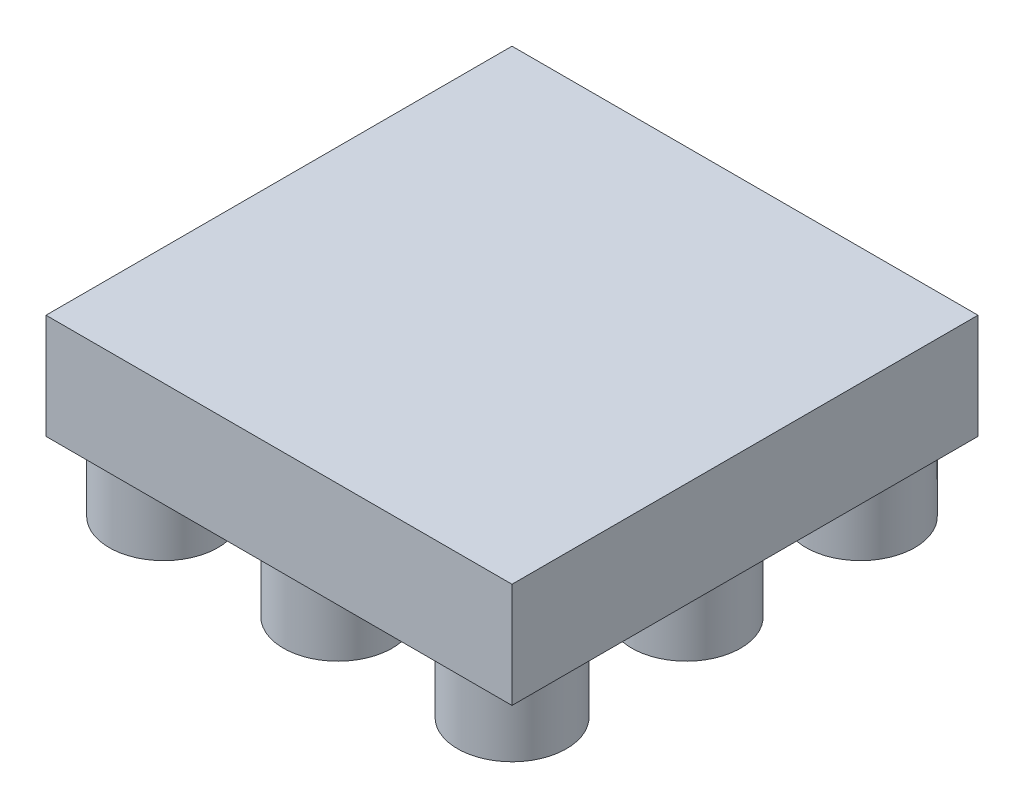
ISO-10303-21;
HEADER;
FILE_DESCRIPTION(('STEP AP214'),'2;1');
FILE_NAME('part.step','',(''),(''),'','','');
FILE_SCHEMA(('AUTOMOTIVE_DESIGN { 1 0 10303 214 1 1 1 1 }'));
ENDSEC;
DATA;
#1=APPLICATION_CONTEXT('core data for automotive mechanical design processes');
#2=APPLICATION_PROTOCOL_DEFINITION('international standard','automotive_design',2000,#1);
#3=PRODUCT_CONTEXT('',#1,'mechanical');
#4=PRODUCT('Part','Part','',(#3));
#5=PRODUCT_RELATED_PRODUCT_CATEGORY('part','',(#4));
#6=PRODUCT_DEFINITION_FORMATION('','',#4);
#7=PRODUCT_DEFINITION_CONTEXT('part definition',#1,'design');
#8=PRODUCT_DEFINITION('design','',#6,#7);
#9=PRODUCT_DEFINITION_SHAPE('','',#8);
#10=(LENGTH_UNIT() NAMED_UNIT(*) SI_UNIT(.MILLI.,.METRE.));
#11=(NAMED_UNIT(*) PLANE_ANGLE_UNIT() SI_UNIT($,.RADIAN.));
#12=(NAMED_UNIT(*) SI_UNIT($,.STERADIAN.) SOLID_ANGLE_UNIT());
#13=UNCERTAINTY_MEASURE_WITH_UNIT(LENGTH_MEASURE(1.E-05),#10,'distance_accuracy_value','');
#14=(GEOMETRIC_REPRESENTATION_CONTEXT(3) GLOBAL_UNCERTAINTY_ASSIGNED_CONTEXT((#13)) GLOBAL_UNIT_ASSIGNED_CONTEXT((#10,
#11,#12)) REPRESENTATION_CONTEXT('',''));
#15=CARTESIAN_POINT('',(0.,0.,0.));
#16=DIRECTION('',(0.,0.,1.));
#17=DIRECTION('',(1.,0.,0.));
#18=AXIS2_PLACEMENT_3D('',#15,#16,#17);
#19=CARTESIAN_POINT('',(7.01,1.5875,-26.31));
#20=DIRECTION('',(0.,-1.,0.));
#21=DIRECTION('',(0.,0.,-1.));
#22=AXIS2_PLACEMENT_3D('',#19,#20,#21);
#23=PLANE('',#22);
#24=CARTESIAN_POINT('',(12.3599999999999,1.5875,-16.96));
#25=DIRECTION('',(0.,-1.,0.));
#26=DIRECTION('',(0.,0.,-1.));
#27=AXIS2_PLACEMENT_3D('',#24,#25,#26);
#28=CIRCLE('',#27,1.25);
#29=CARTESIAN_POINT('',(12.3599999999999,1.5875,-18.21));
#30=VERTEX_POINT('',#29);
#31=EDGE_CURVE('E157',#30,#30,#28,.T.);
#32=ORIENTED_EDGE('',*,*,#31,.F.);
#33=EDGE_LOOP('',(#32));
#34=FACE_BOUND('',#33,.T.);
#35=CARTESIAN_POINT('',(8.35999999999996,1.5875,-20.9600000000001));
#36=DIRECTION('',(0.,-1.,0.));
#37=DIRECTION('',(0.,0.,-1.));
#38=AXIS2_PLACEMENT_3D('',#35,#36,#37);
#39=CIRCLE('',#38,1.25);
#40=CARTESIAN_POINT('',(8.35999999999996,1.5875,-22.2100000000001));
#41=VERTEX_POINT('',#40);
#42=EDGE_CURVE('E145',#41,#41,#39,.T.);
#43=ORIENTED_EDGE('',*,*,#42,.F.);
#44=EDGE_LOOP('',(#43));
#45=FACE_BOUND('',#44,.T.);
#46=CARTESIAN_POINT('',(16.36,1.5875,-20.96));
#47=DIRECTION('',(0.,-1.,0.));
#48=DIRECTION('',(0.,0.,-1.));
#49=AXIS2_PLACEMENT_3D('',#46,#47,#48);
#50=CIRCLE('',#49,1.25);
#51=CARTESIAN_POINT('',(16.36,1.5875,-22.21));
#52=VERTEX_POINT('',#51);
#53=EDGE_CURVE('E133',#52,#52,#50,.T.);
#54=ORIENTED_EDGE('',*,*,#53,.F.);
#55=EDGE_LOOP('',(#54));
#56=FACE_BOUND('',#55,.T.);
#57=CARTESIAN_POINT('',(12.36,1.5875,-24.96));
#58=DIRECTION('',(0.,-1.,0.));
#59=DIRECTION('',(0.,0.,-1.));
#60=AXIS2_PLACEMENT_3D('',#57,#58,#59);
#61=CIRCLE('',#60,1.25);
#62=CARTESIAN_POINT('',(12.36,1.5875,-26.21));
#63=VERTEX_POINT('',#62);
#64=EDGE_CURVE('E121',#63,#63,#61,.T.);
#65=ORIENTED_EDGE('',*,*,#64,.F.);
#66=EDGE_LOOP('',(#65));
#67=FACE_BOUND('',#66,.T.);
#68=DIRECTION('',(0.,0.,1.));
#69=VECTOR('',#68,1.);
#70=CARTESIAN_POINT('',(7.01,1.5875,-15.61));
#71=LINE('',#70,#69);
#72=CARTESIAN_POINT('',(7.01,1.5875,-26.31));
#73=VERTEX_POINT('',#72);
#74=CARTESIAN_POINT('',(7.01,1.5875,-15.61));
#75=VERTEX_POINT('',#74);
#76=EDGE_CURVE('E101',#73,#75,#71,.T.);
#77=ORIENTED_EDGE('',*,*,#76,.F.);
#78=DIRECTION('',(-1.,0.,0.));
#79=VECTOR('',#78,1.);
#80=CARTESIAN_POINT('',(7.01,1.5875,-26.31));
#81=LINE('',#80,#79);
#82=CARTESIAN_POINT('',(17.71,1.5875,-26.31));
#83=VERTEX_POINT('',#82);
#84=EDGE_CURVE('E77',#83,#73,#81,.T.);
#85=ORIENTED_EDGE('',*,*,#84,.F.);
#86=DIRECTION('',(0.,0.,-1.));
#87=VECTOR('',#86,1.);
#88=CARTESIAN_POINT('',(17.71,1.5875,-15.61));
#89=LINE('',#88,#87);
#90=CARTESIAN_POINT('',(17.71,1.5875,-15.61));
#91=VERTEX_POINT('',#90);
#92=EDGE_CURVE('E71',#91,#83,#89,.T.);
#93=ORIENTED_EDGE('',*,*,#92,.F.);
#94=DIRECTION('',(1.,0.,0.));
#95=VECTOR('',#94,1.);
#96=CARTESIAN_POINT('',(7.01,1.5875,-15.61));
#97=LINE('',#96,#95);
#98=EDGE_CURVE('E93',#75,#91,#97,.T.);
#99=ORIENTED_EDGE('',*,*,#98,.F.);
#100=EDGE_LOOP('',(#77,#85,#93,#99));
#101=FACE_BOUND('',#100,.T.);
#102=CARTESIAN_POINT('',(16.36,1.5875,-24.96));
#103=DIRECTION('',(0.,-1.,0.));
#104=DIRECTION('',(0.,0.,-1.));
#105=AXIS2_PLACEMENT_3D('',#102,#103,#104);
#106=CIRCLE('',#105,1.25);
#107=CARTESIAN_POINT('',(16.36,1.5875,-26.21));
#108=VERTEX_POINT('',#107);
#109=EDGE_CURVE('E115',#108,#108,#106,.T.);
#110=ORIENTED_EDGE('',*,*,#109,.F.);
#111=EDGE_LOOP('',(#110));
#112=FACE_BOUND('',#111,.T.);
#113=CARTESIAN_POINT('',(8.35999999999997,1.5875,-24.9600000000001));
#114=DIRECTION('',(0.,-1.,0.));
#115=DIRECTION('',(0.,0.,-1.));
#116=AXIS2_PLACEMENT_3D('',#113,#114,#115);
#117=CIRCLE('',#116,1.25);
#118=CARTESIAN_POINT('',(8.35999999999997,1.5875,-26.2100000000001));
#119=VERTEX_POINT('',#118);
#120=EDGE_CURVE('E127',#119,#119,#117,.T.);
#121=ORIENTED_EDGE('',*,*,#120,.F.);
#122=EDGE_LOOP('',(#121));
#123=FACE_BOUND('',#122,.T.);
#124=CARTESIAN_POINT('',(12.36,1.5875,-20.96));
#125=DIRECTION('',(0.,-1.,0.));
#126=DIRECTION('',(0.,0.,-1.));
#127=AXIS2_PLACEMENT_3D('',#124,#125,#126);
#128=CIRCLE('',#127,1.25);
#129=CARTESIAN_POINT('',(12.36,1.5875,-22.21));
#130=VERTEX_POINT('',#129);
#131=EDGE_CURVE('E139',#130,#130,#128,.T.);
#132=ORIENTED_EDGE('',*,*,#131,.F.);
#133=EDGE_LOOP('',(#132));
#134=FACE_BOUND('',#133,.T.);
#135=CARTESIAN_POINT('',(16.3599999999999,1.5875,-16.96));
#136=DIRECTION('',(0.,-1.,0.));
#137=DIRECTION('',(0.,0.,-1.));
#138=AXIS2_PLACEMENT_3D('',#135,#136,#137);
#139=CIRCLE('',#138,1.25);
#140=CARTESIAN_POINT('',(16.3599999999999,1.5875,-18.21));
#141=VERTEX_POINT('',#140);
#142=EDGE_CURVE('E151',#141,#141,#139,.T.);
#143=ORIENTED_EDGE('',*,*,#142,.F.);
#144=EDGE_LOOP('',(#143));
#145=FACE_BOUND('',#144,.T.);
#146=CARTESIAN_POINT('',(8.35999999999994,1.5875,-16.9600000000001));
#147=DIRECTION('',(0.,-1.,0.));
#148=DIRECTION('',(0.,0.,-1.));
#149=AXIS2_PLACEMENT_3D('',#146,#147,#148);
#150=CIRCLE('',#149,1.25);
#151=CARTESIAN_POINT('',(8.35999999999994,1.5875,-18.2100000000001));
#152=VERTEX_POINT('',#151);
#153=EDGE_CURVE('E163',#152,#152,#150,.T.);
#154=ORIENTED_EDGE('',*,*,#153,.F.);
#155=EDGE_LOOP('',(#154));
#156=FACE_BOUND('',#155,.T.);
#157=ADVANCED_FACE('F37',(#34,#45,#56,#67,#101,#112,#123,#134,#145,#156),#23,.T.);
#158=CARTESIAN_POINT('',(7.01,3.9975,-15.61));
#159=DIRECTION('',(1.,0.,0.));
#160=DIRECTION('',(0.,0.,-1.));
#161=AXIS2_PLACEMENT_3D('',#158,#159,#160);
#162=PLANE('',#161);
#163=ORIENTED_EDGE('',*,*,#76,.T.);
#164=DIRECTION('',(0.,-1.,0.));
#165=VECTOR('',#164,1.);
#166=CARTESIAN_POINT('',(7.01,3.9975,-15.61));
#167=LINE('',#166,#165);
#168=CARTESIAN_POINT('',(7.01,3.9975,-15.61));
#169=VERTEX_POINT('',#168);
#170=EDGE_CURVE('E11',#169,#75,#167,.T.);
#171=ORIENTED_EDGE('',*,*,#170,.F.);
#172=DIRECTION('',(0.,0.,1.));
#173=VECTOR('',#172,1.);
#174=CARTESIAN_POINT('',(7.01,3.9975,-15.61));
#175=LINE('',#174,#173);
#176=CARTESIAN_POINT('',(7.01,3.9975,-26.31));
#177=VERTEX_POINT('',#176);
#178=EDGE_CURVE('E89',#177,#169,#175,.T.);
#179=ORIENTED_EDGE('',*,*,#178,.F.);
#180=DIRECTION('',(0.,-1.,0.));
#181=VECTOR('',#180,1.);
#182=CARTESIAN_POINT('',(7.01,3.9975,-26.31));
#183=LINE('',#182,#181);
#184=EDGE_CURVE('E97',#177,#73,#183,.T.);
#185=ORIENTED_EDGE('',*,*,#184,.T.);
#186=EDGE_LOOP('',(#163,#171,#179,#185));
#187=FACE_BOUND('',#186,.T.);
#188=ADVANCED_FACE('F39',(#187),#162,.F.);
#189=CARTESIAN_POINT('',(7.01,3.9975,-15.61));
#190=DIRECTION('',(0.,0.,-1.));
#191=DIRECTION('',(-1.,0.,0.));
#192=AXIS2_PLACEMENT_3D('',#189,#190,#191);
#193=PLANE('',#192);
#194=ORIENTED_EDGE('',*,*,#98,.T.);
#195=DIRECTION('',(0.,-1.,0.));
#196=VECTOR('',#195,1.);
#197=CARTESIAN_POINT('',(17.71,3.9975,-15.61));
#198=LINE('',#197,#196);
#199=CARTESIAN_POINT('',(17.71,3.9975,-15.61));
#200=VERTEX_POINT('',#199);
#201=EDGE_CURVE('E46',#200,#91,#198,.T.);
#202=ORIENTED_EDGE('',*,*,#201,.F.);
#203=DIRECTION('',(1.,0.,0.));
#204=VECTOR('',#203,1.);
#205=CARTESIAN_POINT('',(7.01,3.9975,-15.61));
#206=LINE('',#205,#204);
#207=EDGE_CURVE('E84',#169,#200,#206,.T.);
#208=ORIENTED_EDGE('',*,*,#207,.F.);
#209=ORIENTED_EDGE('',*,*,#170,.T.);
#210=EDGE_LOOP('',(#194,#202,#208,#209));
#211=FACE_BOUND('',#210,.T.);
#212=ADVANCED_FACE('F92',(#211),#193,.F.);
#213=CARTESIAN_POINT('',(17.71,3.9975,-15.61));
#214=DIRECTION('',(-1.,0.,0.));
#215=DIRECTION('',(0.,0.,1.));
#216=AXIS2_PLACEMENT_3D('',#213,#214,#215);
#217=PLANE('',#216);
#218=ORIENTED_EDGE('',*,*,#92,.T.);
#219=DIRECTION('',(0.,-1.,0.));
#220=VECTOR('',#219,1.);
#221=CARTESIAN_POINT('',(17.71,3.9975,-26.31));
#222=LINE('',#221,#220);
#223=CARTESIAN_POINT('',(17.71,3.9975,-26.31));
#224=VERTEX_POINT('',#223);
#225=EDGE_CURVE('E94',#224,#83,#222,.T.);
#226=ORIENTED_EDGE('',*,*,#225,.F.);
#227=DIRECTION('',(0.,0.,-1.));
#228=VECTOR('',#227,1.);
#229=CARTESIAN_POINT('',(17.71,3.9975,-15.61));
#230=LINE('',#229,#228);
#231=EDGE_CURVE('E87',#200,#224,#230,.T.);
#232=ORIENTED_EDGE('',*,*,#231,.F.);
#233=ORIENTED_EDGE('',*,*,#201,.T.);
#234=EDGE_LOOP('',(#218,#226,#232,#233));
#235=FACE_BOUND('',#234,.T.);
#236=ADVANCED_FACE('F95',(#235),#217,.F.);
#237=CARTESIAN_POINT('',(7.01,3.9975,-26.31));
#238=DIRECTION('',(0.,0.,1.));
#239=DIRECTION('',(1.,0.,0.));
#240=AXIS2_PLACEMENT_3D('',#237,#238,#239);
#241=PLANE('',#240);
#242=ORIENTED_EDGE('',*,*,#84,.T.);
#243=ORIENTED_EDGE('',*,*,#184,.F.);
#244=DIRECTION('',(-1.,0.,0.));
#245=VECTOR('',#244,1.);
#246=CARTESIAN_POINT('',(7.01,3.9975,-26.31));
#247=LINE('',#246,#245);
#248=EDGE_CURVE('E54',#224,#177,#247,.T.);
#249=ORIENTED_EDGE('',*,*,#248,.F.);
#250=ORIENTED_EDGE('',*,*,#225,.T.);
#251=EDGE_LOOP('',(#242,#243,#249,#250));
#252=FACE_BOUND('',#251,.T.);
#253=ADVANCED_FACE('F109',(#252),#241,.F.);
#254=CARTESIAN_POINT('',(7.01,3.9975,-26.31));
#255=DIRECTION('',(0.,-1.,0.));
#256=DIRECTION('',(0.,0.,-1.));
#257=AXIS2_PLACEMENT_3D('',#254,#255,#256);
#258=PLANE('',#257);
#259=ORIENTED_EDGE('',*,*,#178,.T.);
#260=ORIENTED_EDGE('',*,*,#207,.T.);
#261=ORIENTED_EDGE('',*,*,#231,.T.);
#262=ORIENTED_EDGE('',*,*,#248,.T.);
#263=EDGE_LOOP('',(#259,#260,#261,#262));
#264=FACE_BOUND('',#263,.T.);
#265=ADVANCED_FACE('F85',(#264),#258,.F.);
#266=CARTESIAN_POINT('',(16.36,0.,-24.96));
#267=DIRECTION('',(0.,1.,0.));
#268=DIRECTION('',(0.,0.,1.));
#269=AXIS2_PLACEMENT_3D('',#266,#267,#268);
#270=CYLINDRICAL_SURFACE('',#269,1.25);
#271=CARTESIAN_POINT('',(16.36,0.,-24.96));
#272=DIRECTION('',(0.,-1.,0.));
#273=DIRECTION('',(0.,0.,-1.));
#274=AXIS2_PLACEMENT_3D('',#271,#272,#273);
#275=CIRCLE('',#274,1.25);
#276=CARTESIAN_POINT('',(16.36,0.,-26.21));
#277=VERTEX_POINT('',#276);
#278=EDGE_CURVE('E104',#277,#277,#275,.T.);
#279=ORIENTED_EDGE('',*,*,#278,.F.);
#280=EDGE_LOOP('',(#279));
#281=FACE_BOUND('',#280,.T.);
#282=ORIENTED_EDGE('',*,*,#109,.T.);
#283=EDGE_LOOP('',(#282));
#284=FACE_BOUND('',#283,.T.);
#285=ADVANCED_FACE('F211',(#281,#284),#270,.T.);
#286=CARTESIAN_POINT('',(16.36,0.,-24.96));
#287=DIRECTION('',(0.,-1.,0.));
#288=DIRECTION('',(0.,0.,-1.));
#289=AXIS2_PLACEMENT_3D('',#286,#287,#288);
#290=PLANE('',#289);
#291=ORIENTED_EDGE('',*,*,#278,.T.);
#292=EDGE_LOOP('',(#291));
#293=FACE_BOUND('',#292,.T.);
#294=ADVANCED_FACE('F218',(#293),#290,.T.);
#295=CARTESIAN_POINT('',(12.36,0.,-24.96));
#296=DIRECTION('',(0.,1.,0.));
#297=DIRECTION('',(0.,0.,1.));
#298=AXIS2_PLACEMENT_3D('',#295,#296,#297);
#299=CYLINDRICAL_SURFACE('',#298,1.25);
#300=CARTESIAN_POINT('',(12.36,0.,-24.96));
#301=DIRECTION('',(0.,-1.,0.));
#302=DIRECTION('',(0.,0.,-1.));
#303=AXIS2_PLACEMENT_3D('',#300,#301,#302);
#304=CIRCLE('',#303,1.25);
#305=CARTESIAN_POINT('',(12.36,0.,-26.21));
#306=VERTEX_POINT('',#305);
#307=EDGE_CURVE('E118',#306,#306,#304,.T.);
#308=ORIENTED_EDGE('',*,*,#307,.F.);
#309=EDGE_LOOP('',(#308));
#310=FACE_BOUND('',#309,.T.);
#311=ORIENTED_EDGE('',*,*,#64,.T.);
#312=EDGE_LOOP('',(#311));
#313=FACE_BOUND('',#312,.T.);
#314=ADVANCED_FACE('F225',(#310,#313),#299,.T.);
#315=CARTESIAN_POINT('',(12.36,0.,-24.96));
#316=DIRECTION('',(0.,-1.,0.));
#317=DIRECTION('',(0.,0.,-1.));
#318=AXIS2_PLACEMENT_3D('',#315,#316,#317);
#319=PLANE('',#318);
#320=ORIENTED_EDGE('',*,*,#307,.T.);
#321=EDGE_LOOP('',(#320));
#322=FACE_BOUND('',#321,.T.);
#323=ADVANCED_FACE('F233',(#322),#319,.T.);
#324=CARTESIAN_POINT('',(8.35999999999997,0.,-24.9600000000001));
#325=DIRECTION('',(0.,1.,0.));
#326=DIRECTION('',(0.,0.,1.));
#327=AXIS2_PLACEMENT_3D('',#324,#325,#326);
#328=CYLINDRICAL_SURFACE('',#327,1.25);
#329=CARTESIAN_POINT('',(8.35999999999997,0.,-24.9600000000001));
#330=DIRECTION('',(0.,-1.,0.));
#331=DIRECTION('',(0.,0.,-1.));
#332=AXIS2_PLACEMENT_3D('',#329,#330,#331);
#333=CIRCLE('',#332,1.25);
#334=CARTESIAN_POINT('',(8.35999999999997,0.,-26.2100000000001));
#335=VERTEX_POINT('',#334);
#336=EDGE_CURVE('E124',#335,#335,#333,.T.);
#337=ORIENTED_EDGE('',*,*,#336,.F.);
#338=EDGE_LOOP('',(#337));
#339=FACE_BOUND('',#338,.T.);
#340=ORIENTED_EDGE('',*,*,#120,.T.);
#341=EDGE_LOOP('',(#340));
#342=FACE_BOUND('',#341,.T.);
#343=ADVANCED_FACE('F241',(#339,#342),#328,.T.);
#344=CARTESIAN_POINT('',(8.35999999999997,0.,-24.9600000000001));
#345=DIRECTION('',(0.,-1.,0.));
#346=DIRECTION('',(0.,0.,-1.));
#347=AXIS2_PLACEMENT_3D('',#344,#345,#346);
#348=PLANE('',#347);
#349=ORIENTED_EDGE('',*,*,#336,.T.);
#350=EDGE_LOOP('',(#349));
#351=FACE_BOUND('',#350,.T.);
#352=ADVANCED_FACE('F249',(#351),#348,.T.);
#353=CARTESIAN_POINT('',(16.36,0.,-20.96));
#354=DIRECTION('',(0.,1.,0.));
#355=DIRECTION('',(0.,0.,1.));
#356=AXIS2_PLACEMENT_3D('',#353,#354,#355);
#357=CYLINDRICAL_SURFACE('',#356,1.25);
#358=CARTESIAN_POINT('',(16.36,0.,-20.96));
#359=DIRECTION('',(0.,-1.,0.));
#360=DIRECTION('',(0.,0.,-1.));
#361=AXIS2_PLACEMENT_3D('',#358,#359,#360);
#362=CIRCLE('',#361,1.25);
#363=CARTESIAN_POINT('',(16.36,0.,-22.21));
#364=VERTEX_POINT('',#363);
#365=EDGE_CURVE('E130',#364,#364,#362,.T.);
#366=ORIENTED_EDGE('',*,*,#365,.F.);
#367=EDGE_LOOP('',(#366));
#368=FACE_BOUND('',#367,.T.);
#369=ORIENTED_EDGE('',*,*,#53,.T.);
#370=EDGE_LOOP('',(#369));
#371=FACE_BOUND('',#370,.T.);
#372=ADVANCED_FACE('F257',(#368,#371),#357,.T.);
#373=CARTESIAN_POINT('',(16.36,0.,-20.96));
#374=DIRECTION('',(0.,-1.,0.));
#375=DIRECTION('',(0.,0.,-1.));
#376=AXIS2_PLACEMENT_3D('',#373,#374,#375);
#377=PLANE('',#376);
#378=ORIENTED_EDGE('',*,*,#365,.T.);
#379=EDGE_LOOP('',(#378));
#380=FACE_BOUND('',#379,.T.);
#381=ADVANCED_FACE('F265',(#380),#377,.T.);
#382=CARTESIAN_POINT('',(12.36,0.,-20.96));
#383=DIRECTION('',(0.,1.,0.));
#384=DIRECTION('',(0.,0.,1.));
#385=AXIS2_PLACEMENT_3D('',#382,#383,#384);
#386=CYLINDRICAL_SURFACE('',#385,1.25);
#387=CARTESIAN_POINT('',(12.36,0.,-20.96));
#388=DIRECTION('',(0.,-1.,0.));
#389=DIRECTION('',(0.,0.,-1.));
#390=AXIS2_PLACEMENT_3D('',#387,#388,#389);
#391=CIRCLE('',#390,1.25);
#392=CARTESIAN_POINT('',(12.36,0.,-22.21));
#393=VERTEX_POINT('',#392);
#394=EDGE_CURVE('E136',#393,#393,#391,.T.);
#395=ORIENTED_EDGE('',*,*,#394,.F.);
#396=EDGE_LOOP('',(#395));
#397=FACE_BOUND('',#396,.T.);
#398=ORIENTED_EDGE('',*,*,#131,.T.);
#399=EDGE_LOOP('',(#398));
#400=FACE_BOUND('',#399,.T.);
#401=ADVANCED_FACE('F273',(#397,#400),#386,.T.);
#402=CARTESIAN_POINT('',(12.36,0.,-20.96));
#403=DIRECTION('',(0.,-1.,0.));
#404=DIRECTION('',(0.,0.,-1.));
#405=AXIS2_PLACEMENT_3D('',#402,#403,#404);
#406=PLANE('',#405);
#407=ORIENTED_EDGE('',*,*,#394,.T.);
#408=EDGE_LOOP('',(#407));
#409=FACE_BOUND('',#408,.T.);
#410=ADVANCED_FACE('F281',(#409),#406,.T.);
#411=CARTESIAN_POINT('',(8.35999999999996,0.,-20.9600000000001));
#412=DIRECTION('',(0.,1.,0.));
#413=DIRECTION('',(0.,0.,1.));
#414=AXIS2_PLACEMENT_3D('',#411,#412,#413);
#415=CYLINDRICAL_SURFACE('',#414,1.25);
#416=CARTESIAN_POINT('',(8.35999999999996,0.,-20.9600000000001));
#417=DIRECTION('',(0.,-1.,0.));
#418=DIRECTION('',(0.,0.,-1.));
#419=AXIS2_PLACEMENT_3D('',#416,#417,#418);
#420=CIRCLE('',#419,1.25);
#421=CARTESIAN_POINT('',(8.35999999999996,0.,-22.2100000000001));
#422=VERTEX_POINT('',#421);
#423=EDGE_CURVE('E142',#422,#422,#420,.T.);
#424=ORIENTED_EDGE('',*,*,#423,.F.);
#425=EDGE_LOOP('',(#424));
#426=FACE_BOUND('',#425,.T.);
#427=ORIENTED_EDGE('',*,*,#42,.T.);
#428=EDGE_LOOP('',(#427));
#429=FACE_BOUND('',#428,.T.);
#430=ADVANCED_FACE('F289',(#426,#429),#415,.T.);
#431=CARTESIAN_POINT('',(8.35999999999996,0.,-20.9600000000001));
#432=DIRECTION('',(0.,-1.,0.));
#433=DIRECTION('',(0.,0.,-1.));
#434=AXIS2_PLACEMENT_3D('',#431,#432,#433);
#435=PLANE('',#434);
#436=ORIENTED_EDGE('',*,*,#423,.T.);
#437=EDGE_LOOP('',(#436));
#438=FACE_BOUND('',#437,.T.);
#439=ADVANCED_FACE('F297',(#438),#435,.T.);
#440=CARTESIAN_POINT('',(16.3599999999999,0.,-16.96));
#441=DIRECTION('',(0.,1.,0.));
#442=DIRECTION('',(0.,0.,1.));
#443=AXIS2_PLACEMENT_3D('',#440,#441,#442);
#444=CYLINDRICAL_SURFACE('',#443,1.25);
#445=CARTESIAN_POINT('',(16.3599999999999,0.,-16.96));
#446=DIRECTION('',(0.,-1.,0.));
#447=DIRECTION('',(0.,0.,-1.));
#448=AXIS2_PLACEMENT_3D('',#445,#446,#447);
#449=CIRCLE('',#448,1.25);
#450=CARTESIAN_POINT('',(16.3599999999999,0.,-18.21));
#451=VERTEX_POINT('',#450);
#452=EDGE_CURVE('E148',#451,#451,#449,.T.);
#453=ORIENTED_EDGE('',*,*,#452,.F.);
#454=EDGE_LOOP('',(#453));
#455=FACE_BOUND('',#454,.T.);
#456=ORIENTED_EDGE('',*,*,#142,.T.);
#457=EDGE_LOOP('',(#456));
#458=FACE_BOUND('',#457,.T.);
#459=ADVANCED_FACE('F305',(#455,#458),#444,.T.);
#460=CARTESIAN_POINT('',(16.3599999999999,0.,-16.96));
#461=DIRECTION('',(0.,-1.,0.));
#462=DIRECTION('',(0.,0.,-1.));
#463=AXIS2_PLACEMENT_3D('',#460,#461,#462);
#464=PLANE('',#463);
#465=ORIENTED_EDGE('',*,*,#452,.T.);
#466=EDGE_LOOP('',(#465));
#467=FACE_BOUND('',#466,.T.);
#468=ADVANCED_FACE('F313',(#467),#464,.T.);
#469=CARTESIAN_POINT('',(12.3599999999999,0.,-16.96));
#470=DIRECTION('',(0.,1.,0.));
#471=DIRECTION('',(0.,0.,1.));
#472=AXIS2_PLACEMENT_3D('',#469,#470,#471);
#473=CYLINDRICAL_SURFACE('',#472,1.25);
#474=CARTESIAN_POINT('',(12.3599999999999,0.,-16.96));
#475=DIRECTION('',(0.,-1.,0.));
#476=DIRECTION('',(0.,0.,-1.));
#477=AXIS2_PLACEMENT_3D('',#474,#475,#476);
#478=CIRCLE('',#477,1.25);
#479=CARTESIAN_POINT('',(12.3599999999999,0.,-18.21));
#480=VERTEX_POINT('',#479);
#481=EDGE_CURVE('E154',#480,#480,#478,.T.);
#482=ORIENTED_EDGE('',*,*,#481,.F.);
#483=EDGE_LOOP('',(#482));
#484=FACE_BOUND('',#483,.T.);
#485=ORIENTED_EDGE('',*,*,#31,.T.);
#486=EDGE_LOOP('',(#485));
#487=FACE_BOUND('',#486,.T.);
#488=ADVANCED_FACE('F321',(#484,#487),#473,.T.);
#489=CARTESIAN_POINT('',(12.3599999999999,0.,-16.96));
#490=DIRECTION('',(0.,-1.,0.));
#491=DIRECTION('',(0.,0.,-1.));
#492=AXIS2_PLACEMENT_3D('',#489,#490,#491);
#493=PLANE('',#492);
#494=ORIENTED_EDGE('',*,*,#481,.T.);
#495=EDGE_LOOP('',(#494));
#496=FACE_BOUND('',#495,.T.);
#497=ADVANCED_FACE('F174',(#496),#493,.T.);
#498=CARTESIAN_POINT('',(8.35999999999994,0.,-16.9600000000001));
#499=DIRECTION('',(0.,1.,0.));
#500=DIRECTION('',(0.,0.,1.));
#501=AXIS2_PLACEMENT_3D('',#498,#499,#500);
#502=CYLINDRICAL_SURFACE('',#501,1.25);
#503=CARTESIAN_POINT('',(8.35999999999994,0.,-16.9600000000001));
#504=DIRECTION('',(0.,-1.,0.));
#505=DIRECTION('',(0.,0.,-1.));
#506=AXIS2_PLACEMENT_3D('',#503,#504,#505);
#507=CIRCLE('',#506,1.25);
#508=CARTESIAN_POINT('',(8.35999999999994,0.,-18.2100000000001));
#509=VERTEX_POINT('',#508);
#510=EDGE_CURVE('E160',#509,#509,#507,.T.);
#511=ORIENTED_EDGE('',*,*,#510,.F.);
#512=EDGE_LOOP('',(#511));
#513=FACE_BOUND('',#512,.T.);
#514=ORIENTED_EDGE('',*,*,#153,.T.);
#515=EDGE_LOOP('',(#514));
#516=FACE_BOUND('',#515,.T.);
#517=ADVANCED_FACE('F171',(#513,#516),#502,.T.);
#518=CARTESIAN_POINT('',(8.35999999999994,0.,-16.9600000000001));
#519=DIRECTION('',(0.,-1.,0.));
#520=DIRECTION('',(0.,0.,-1.));
#521=AXIS2_PLACEMENT_3D('',#518,#519,#520);
#522=PLANE('',#521);
#523=ORIENTED_EDGE('',*,*,#510,.T.);
#524=EDGE_LOOP('',(#523));
#525=FACE_BOUND('',#524,.T.);
#526=ADVANCED_FACE('F169',(#525),#522,.T.);
#527=CLOSED_SHELL('',(#157,#188,#212,#236,#253,#265,#285,#294,#314,#323,#343,#352,#372,#381,
#401,#410,#430,#439,#459,#468,#488,#497,#517,#526));
#528=MANIFOLD_SOLID_BREP('B2',#527);
#529=ADVANCED_BREP_SHAPE_REPRESENTATION('',(#18,#528),#14);
#530=SHAPE_DEFINITION_REPRESENTATION(#9,#529);
ENDSEC;
END-ISO-10303-21;
